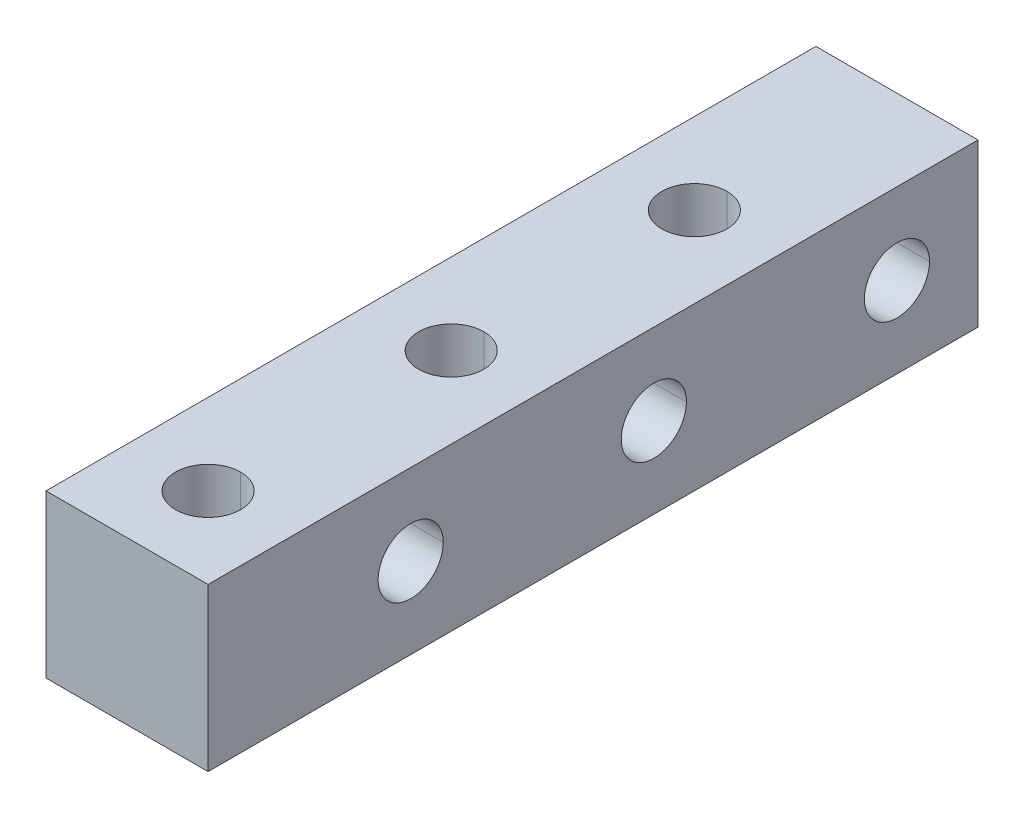
ISO-10303-21;
HEADER;
FILE_DESCRIPTION(('STEP AP214'),'2;1');
FILE_NAME('part.step','',(''),(''),'','','');
FILE_SCHEMA(('AUTOMOTIVE_DESIGN { 1 0 10303 214 1 1 1 1 }'));
ENDSEC;
DATA;
#1=APPLICATION_CONTEXT('core data for automotive mechanical design processes');
#2=APPLICATION_PROTOCOL_DEFINITION('international standard','automotive_design',2000,#1);
#3=PRODUCT_CONTEXT('',#1,'mechanical');
#4=PRODUCT('Part','Part','',(#3));
#5=PRODUCT_RELATED_PRODUCT_CATEGORY('part','',(#4));
#6=PRODUCT_DEFINITION_FORMATION('','',#4);
#7=PRODUCT_DEFINITION_CONTEXT('part definition',#1,'design');
#8=PRODUCT_DEFINITION('design','',#6,#7);
#9=PRODUCT_DEFINITION_SHAPE('','',#8);
#10=(LENGTH_UNIT() NAMED_UNIT(*) SI_UNIT(.MILLI.,.METRE.));
#11=(NAMED_UNIT(*) PLANE_ANGLE_UNIT() SI_UNIT($,.RADIAN.));
#12=(NAMED_UNIT(*) SI_UNIT($,.STERADIAN.) SOLID_ANGLE_UNIT());
#13=UNCERTAINTY_MEASURE_WITH_UNIT(LENGTH_MEASURE(1.E-05),#10,'distance_accuracy_value','');
#14=(GEOMETRIC_REPRESENTATION_CONTEXT(3) GLOBAL_UNCERTAINTY_ASSIGNED_CONTEXT((#13)) GLOBAL_UNIT_ASSIGNED_CONTEXT((#10,
#11,#12)) REPRESENTATION_CONTEXT('',''));
#15=CARTESIAN_POINT('',(0.,0.,0.));
#16=DIRECTION('',(0.,0.,1.));
#17=DIRECTION('',(1.,0.,0.));
#18=AXIS2_PLACEMENT_3D('',#15,#16,#17);
#19=CARTESIAN_POINT('',(6.35,0.,-53.975));
#20=DIRECTION('',(1.,0.,0.));
#21=DIRECTION('',(0.,0.,-1.));
#22=AXIS2_PLACEMENT_3D('',#19,#20,#21);
#23=CYLINDRICAL_SURFACE('',#22,2.5527);
#24=DIRECTION('',(1.,0.,0.));
#25=VECTOR('',#24,1.);
#26=CARTESIAN_POINT('',(6.35,0.,-51.4223));
#27=LINE('',#26,#25);
#28=CARTESIAN_POINT('',(-6.35,0.,-51.4223));
#29=VERTEX_POINT('',#28);
#30=CARTESIAN_POINT('',(6.35,0.,-51.4223));
#31=VERTEX_POINT('',#30);
#32=EDGE_CURVE('E278',#29,#31,#27,.T.);
#33=ORIENTED_EDGE('',*,*,#32,.F.);
#34=CARTESIAN_POINT('',(-6.35,0.,-53.975));
#35=DIRECTION('',(1.,0.,0.));
#36=DIRECTION('',(0.,0.,-1.));
#37=AXIS2_PLACEMENT_3D('',#34,#35,#36);
#38=CIRCLE('',#37,2.5527);
#39=CARTESIAN_POINT('',(-6.35,0.,-56.5277));
#40=VERTEX_POINT('',#39);
#41=EDGE_CURVE('E272',#40,#29,#38,.T.);
#42=ORIENTED_EDGE('',*,*,#41,.F.);
#43=DIRECTION('',(1.,0.,0.));
#44=VECTOR('',#43,1.);
#45=CARTESIAN_POINT('',(6.35,0.,-56.5277));
#46=LINE('',#45,#44);
#47=CARTESIAN_POINT('',(6.35,0.,-56.5277));
#48=VERTEX_POINT('',#47);
#49=EDGE_CURVE('E277',#40,#48,#46,.T.);
#50=ORIENTED_EDGE('',*,*,#49,.T.);
#51=CARTESIAN_POINT('',(6.35,0.,-53.975));
#52=DIRECTION('',(1.,0.,0.));
#53=DIRECTION('',(0.,0.,-1.));
#54=AXIS2_PLACEMENT_3D('',#51,#52,#53);
#55=CIRCLE('',#54,2.5527);
#56=EDGE_CURVE('E268',#48,#31,#55,.T.);
#57=ORIENTED_EDGE('',*,*,#56,.T.);
#58=EDGE_LOOP('',(#33,#42,#50,#57));
#59=FACE_BOUND('',#58,.T.);
#60=ADVANCED_FACE('F51',(#59),#23,.F.);
#61=CARTESIAN_POINT('',(6.35,0.,-34.925));
#62=DIRECTION('',(1.,0.,0.));
#63=DIRECTION('',(0.,0.,-1.));
#64=AXIS2_PLACEMENT_3D('',#61,#62,#63);
#65=CYLINDRICAL_SURFACE('',#64,2.5527);
#66=DIRECTION('',(1.,0.,0.));
#67=VECTOR('',#66,1.);
#68=CARTESIAN_POINT('',(6.35,0.,-32.3723));
#69=LINE('',#68,#67);
#70=CARTESIAN_POINT('',(-6.35,0.,-32.3723));
#71=VERTEX_POINT('',#70);
#72=CARTESIAN_POINT('',(6.35,0.,-32.3723));
#73=VERTEX_POINT('',#72);
#74=EDGE_CURVE('E279',#71,#73,#69,.T.);
#75=ORIENTED_EDGE('',*,*,#74,.F.);
#76=CARTESIAN_POINT('',(-6.35,0.,-34.925));
#77=DIRECTION('',(1.,0.,0.));
#78=DIRECTION('',(0.,0.,-1.));
#79=AXIS2_PLACEMENT_3D('',#76,#77,#78);
#80=CIRCLE('',#79,2.5527);
#81=CARTESIAN_POINT('',(-6.35,0.,-37.4777));
#82=VERTEX_POINT('',#81);
#83=EDGE_CURVE('E130',#82,#71,#80,.T.);
#84=ORIENTED_EDGE('',*,*,#83,.F.);
#85=DIRECTION('',(1.,0.,0.));
#86=VECTOR('',#85,1.);
#87=CARTESIAN_POINT('',(6.35,0.,-37.4777));
#88=LINE('',#87,#86);
#89=CARTESIAN_POINT('',(6.35,0.,-37.4777));
#90=VERTEX_POINT('',#89);
#91=EDGE_CURVE('E245',#82,#90,#88,.T.);
#92=ORIENTED_EDGE('',*,*,#91,.T.);
#93=CARTESIAN_POINT('',(6.35,0.,-34.925));
#94=DIRECTION('',(1.,0.,0.));
#95=DIRECTION('',(0.,0.,-1.));
#96=AXIS2_PLACEMENT_3D('',#93,#94,#95);
#97=CIRCLE('',#96,2.5527);
#98=EDGE_CURVE('E61',#90,#73,#97,.T.);
#99=ORIENTED_EDGE('',*,*,#98,.T.);
#100=EDGE_LOOP('',(#75,#84,#92,#99));
#101=FACE_BOUND('',#100,.T.);
#102=ADVANCED_FACE('F362',(#101),#65,.F.);
#103=CARTESIAN_POINT('',(0.,6.35,-44.45));
#104=DIRECTION('',(0.,1.,0.));
#105=DIRECTION('',(0.,0.,1.));
#106=AXIS2_PLACEMENT_3D('',#103,#104,#105);
#107=CYLINDRICAL_SURFACE('',#106,2.5527);
#108=DIRECTION('',(0.,1.,0.));
#109=VECTOR('',#108,1.);
#110=CARTESIAN_POINT('',(0.,6.35,-47.0027));
#111=LINE('',#110,#109);
#112=CARTESIAN_POINT('',(0.,-6.35,-47.0027));
#113=VERTEX_POINT('',#112);
#114=CARTESIAN_POINT('',(0.,6.35,-47.0027));
#115=VERTEX_POINT('',#114);
#116=EDGE_CURVE('E227',#113,#115,#111,.T.);
#117=ORIENTED_EDGE('',*,*,#116,.F.);
#118=CARTESIAN_POINT('',(0.,-6.35,-44.45));
#119=DIRECTION('',(0.,1.,0.));
#120=DIRECTION('',(0.,0.,1.));
#121=AXIS2_PLACEMENT_3D('',#118,#119,#120);
#122=CIRCLE('',#121,2.5527);
#123=CARTESIAN_POINT('',(0.,-6.35,-41.8973));
#124=VERTEX_POINT('',#123);
#125=EDGE_CURVE('E220',#124,#113,#122,.T.);
#126=ORIENTED_EDGE('',*,*,#125,.F.);
#127=DIRECTION('',(0.,1.,0.));
#128=VECTOR('',#127,1.);
#129=CARTESIAN_POINT('',(0.,6.35,-41.8973));
#130=LINE('',#129,#128);
#131=CARTESIAN_POINT('',(0.,6.35,-41.8973));
#132=VERTEX_POINT('',#131);
#133=EDGE_CURVE('E218',#124,#132,#130,.T.);
#134=ORIENTED_EDGE('',*,*,#133,.T.);
#135=CARTESIAN_POINT('',(0.,6.35,-44.45));
#136=DIRECTION('',(0.,1.,0.));
#137=DIRECTION('',(0.,0.,1.));
#138=AXIS2_PLACEMENT_3D('',#135,#136,#137);
#139=CIRCLE('',#138,2.5527);
#140=EDGE_CURVE('E206',#132,#115,#139,.T.);
#141=ORIENTED_EDGE('',*,*,#140,.T.);
#142=EDGE_LOOP('',(#117,#126,#134,#141));
#143=FACE_BOUND('',#142,.T.);
#144=ADVANCED_FACE('F219',(#143),#107,.F.);
#145=CARTESIAN_POINT('',(0.,6.35,-25.4));
#146=DIRECTION('',(0.,1.,0.));
#147=DIRECTION('',(0.,0.,1.));
#148=AXIS2_PLACEMENT_3D('',#145,#146,#147);
#149=CYLINDRICAL_SURFACE('',#148,2.5527);
#150=DIRECTION('',(0.,1.,0.));
#151=VECTOR('',#150,1.);
#152=CARTESIAN_POINT('',(0.,6.35,-27.9527));
#153=LINE('',#152,#151);
#154=CARTESIAN_POINT('',(0.,-6.35,-27.9527));
#155=VERTEX_POINT('',#154);
#156=CARTESIAN_POINT('',(0.,6.35,-27.9527));
#157=VERTEX_POINT('',#156);
#158=EDGE_CURVE('E255',#155,#157,#153,.T.);
#159=ORIENTED_EDGE('',*,*,#158,.F.);
#160=CARTESIAN_POINT('',(0.,-6.35,-25.4));
#161=DIRECTION('',(0.,1.,0.));
#162=DIRECTION('',(0.,0.,1.));
#163=AXIS2_PLACEMENT_3D('',#160,#161,#162);
#164=CIRCLE('',#163,2.5527);
#165=CARTESIAN_POINT('',(0.,-6.35,-22.8473));
#166=VERTEX_POINT('',#165);
#167=EDGE_CURVE('E200',#166,#155,#164,.T.);
#168=ORIENTED_EDGE('',*,*,#167,.F.);
#169=DIRECTION('',(0.,1.,0.));
#170=VECTOR('',#169,1.);
#171=CARTESIAN_POINT('',(0.,6.35,-22.8473));
#172=LINE('',#171,#170);
#173=CARTESIAN_POINT('',(0.,6.35,-22.8473));
#174=VERTEX_POINT('',#173);
#175=EDGE_CURVE('E249',#166,#174,#172,.T.);
#176=ORIENTED_EDGE('',*,*,#175,.T.);
#177=CARTESIAN_POINT('',(0.,6.35,-25.4));
#178=DIRECTION('',(0.,1.,0.));
#179=DIRECTION('',(0.,0.,1.));
#180=AXIS2_PLACEMENT_3D('',#177,#178,#179);
#181=CIRCLE('',#180,2.5527);
#182=EDGE_CURVE('E215',#174,#157,#181,.T.);
#183=ORIENTED_EDGE('',*,*,#182,.T.);
#184=EDGE_LOOP('',(#159,#168,#176,#183));
#185=FACE_BOUND('',#184,.T.);
#186=ADVANCED_FACE('F370',(#185),#149,.F.);
#187=CARTESIAN_POINT('',(6.35,0.,-15.875));
#188=DIRECTION('',(1.,0.,0.));
#189=DIRECTION('',(0.,0.,-1.));
#190=AXIS2_PLACEMENT_3D('',#187,#188,#189);
#191=CYLINDRICAL_SURFACE('',#190,2.5527);
#192=DIRECTION('',(1.,0.,0.));
#193=VECTOR('',#192,1.);
#194=CARTESIAN_POINT('',(6.35,0.,-13.3223));
#195=LINE('',#194,#193);
#196=CARTESIAN_POINT('',(-6.35,0.,-13.3223));
#197=VERTEX_POINT('',#196);
#198=CARTESIAN_POINT('',(6.35,0.,-13.3223));
#199=VERTEX_POINT('',#198);
#200=EDGE_CURVE('E294',#197,#199,#195,.T.);
#201=ORIENTED_EDGE('',*,*,#200,.F.);
#202=CARTESIAN_POINT('',(-6.35,0.,-15.875));
#203=DIRECTION('',(1.,0.,0.));
#204=DIRECTION('',(0.,0.,-1.));
#205=AXIS2_PLACEMENT_3D('',#202,#203,#204);
#206=CIRCLE('',#205,2.5527);
#207=CARTESIAN_POINT('',(-6.35,0.,-18.4277));
#208=VERTEX_POINT('',#207);
#209=EDGE_CURVE('E271',#208,#197,#206,.T.);
#210=ORIENTED_EDGE('',*,*,#209,.F.);
#211=DIRECTION('',(1.,0.,0.));
#212=VECTOR('',#211,1.);
#213=CARTESIAN_POINT('',(6.35,0.,-18.4277));
#214=LINE('',#213,#212);
#215=CARTESIAN_POINT('',(6.35,0.,-18.4277));
#216=VERTEX_POINT('',#215);
#217=EDGE_CURVE('E238',#208,#216,#214,.T.);
#218=ORIENTED_EDGE('',*,*,#217,.T.);
#219=CARTESIAN_POINT('',(6.35,0.,-15.875));
#220=DIRECTION('',(1.,0.,0.));
#221=DIRECTION('',(0.,0.,-1.));
#222=AXIS2_PLACEMENT_3D('',#219,#220,#221);
#223=CIRCLE('',#222,2.5527);
#224=EDGE_CURVE('E11',#216,#199,#223,.T.);
#225=ORIENTED_EDGE('',*,*,#224,.T.);
#226=EDGE_LOOP('',(#201,#210,#218,#225));
#227=FACE_BOUND('',#226,.T.);
#228=ADVANCED_FACE('F389',(#227),#191,.F.);
#229=CARTESIAN_POINT('',(0.,6.35,-6.35));
#230=DIRECTION('',(0.,1.,0.));
#231=DIRECTION('',(0.,0.,1.));
#232=AXIS2_PLACEMENT_3D('',#229,#230,#231);
#233=CYLINDRICAL_SURFACE('',#232,2.5527);
#234=DIRECTION('',(0.,1.,0.));
#235=VECTOR('',#234,1.);
#236=CARTESIAN_POINT('',(0.,6.35,-8.9027));
#237=LINE('',#236,#235);
#238=CARTESIAN_POINT('',(0.,-6.35,-8.9027));
#239=VERTEX_POINT('',#238);
#240=CARTESIAN_POINT('',(0.,6.35,-8.9027));
#241=VERTEX_POINT('',#240);
#242=EDGE_CURVE('E298',#239,#241,#237,.T.);
#243=ORIENTED_EDGE('',*,*,#242,.F.);
#244=CARTESIAN_POINT('',(0.,-6.35,-6.35));
#245=DIRECTION('',(0.,1.,0.));
#246=DIRECTION('',(0.,0.,1.));
#247=AXIS2_PLACEMENT_3D('',#244,#245,#246);
#248=CIRCLE('',#247,2.5527);
#249=CARTESIAN_POINT('',(0.,-6.35,-3.7973));
#250=VERTEX_POINT('',#249);
#251=EDGE_CURVE('E265',#250,#239,#248,.T.);
#252=ORIENTED_EDGE('',*,*,#251,.F.);
#253=DIRECTION('',(0.,1.,0.));
#254=VECTOR('',#253,1.);
#255=CARTESIAN_POINT('',(0.,6.35,-3.7973));
#256=LINE('',#255,#254);
#257=CARTESIAN_POINT('',(0.,6.35,-3.7973));
#258=VERTEX_POINT('',#257);
#259=EDGE_CURVE('E240',#250,#258,#256,.T.);
#260=ORIENTED_EDGE('',*,*,#259,.T.);
#261=CARTESIAN_POINT('',(0.,6.35,-6.35));
#262=DIRECTION('',(0.,1.,0.));
#263=DIRECTION('',(0.,0.,1.));
#264=AXIS2_PLACEMENT_3D('',#261,#262,#263);
#265=CIRCLE('',#264,2.5527);
#266=EDGE_CURVE('E303',#258,#241,#265,.T.);
#267=ORIENTED_EDGE('',*,*,#266,.T.);
#268=EDGE_LOOP('',(#243,#252,#260,#267));
#269=FACE_BOUND('',#268,.T.);
#270=ADVANCED_FACE('F387',(#269),#233,.F.);
#271=CARTESIAN_POINT('',(-6.35,6.35,0.));
#272=DIRECTION('',(0.,0.,1.));
#273=DIRECTION('',(1.,0.,0.));
#274=AXIS2_PLACEMENT_3D('',#271,#272,#273);
#275=PLANE('',#274);
#276=DIRECTION('',(0.,-1.,0.));
#277=VECTOR('',#276,1.);
#278=CARTESIAN_POINT('',(-6.35,-6.35,0.));
#279=LINE('',#278,#277);
#280=CARTESIAN_POINT('',(-6.35,6.35,0.));
#281=VERTEX_POINT('',#280);
#282=CARTESIAN_POINT('',(-6.35,-6.35,0.));
#283=VERTEX_POINT('',#282);
#284=EDGE_CURVE('E301',#281,#283,#279,.T.);
#285=ORIENTED_EDGE('',*,*,#284,.T.);
#286=DIRECTION('',(1.,0.,0.));
#287=VECTOR('',#286,1.);
#288=CARTESIAN_POINT('',(6.35,-6.35,0.));
#289=LINE('',#288,#287);
#290=CARTESIAN_POINT('',(6.35,-6.35,0.));
#291=VERTEX_POINT('',#290);
#292=EDGE_CURVE('E259',#283,#291,#289,.T.);
#293=ORIENTED_EDGE('',*,*,#292,.T.);
#294=DIRECTION('',(0.,1.,0.));
#295=VECTOR('',#294,1.);
#296=CARTESIAN_POINT('',(6.35,-6.35,0.));
#297=LINE('',#296,#295);
#298=CARTESIAN_POINT('',(6.35,6.35,0.));
#299=VERTEX_POINT('',#298);
#300=EDGE_CURVE('E306',#291,#299,#297,.T.);
#301=ORIENTED_EDGE('',*,*,#300,.T.);
#302=DIRECTION('',(-1.,0.,0.));
#303=VECTOR('',#302,1.);
#304=CARTESIAN_POINT('',(6.35,6.35,0.));
#305=LINE('',#304,#303);
#306=EDGE_CURVE('E284',#299,#281,#305,.T.);
#307=ORIENTED_EDGE('',*,*,#306,.T.);
#308=EDGE_LOOP('',(#285,#293,#301,#307));
#309=FACE_BOUND('',#308,.T.);
#310=ADVANCED_FACE('F384',(#309),#275,.T.);
#311=CARTESIAN_POINT('',(6.35,-6.35,-85.725));
#312=DIRECTION('',(1.,0.,0.));
#313=DIRECTION('',(0.,1.,0.));
#314=AXIS2_PLACEMENT_3D('',#311,#312,#313);
#315=PLANE('',#314);
#316=DIRECTION('',(0.,-1.,0.));
#317=VECTOR('',#316,1.);
#318=CARTESIAN_POINT('',(6.35,6.35,-60.325));
#319=LINE('',#318,#317);
#320=CARTESIAN_POINT('',(6.35,6.35,-60.325));
#321=VERTEX_POINT('',#320);
#322=CARTESIAN_POINT('',(6.35,-6.35,-60.325));
#323=VERTEX_POINT('',#322);
#324=EDGE_CURVE('E69',#321,#323,#319,.T.);
#325=ORIENTED_EDGE('',*,*,#324,.F.);
#326=DIRECTION('',(0.,0.,1.));
#327=VECTOR('',#326,1.);
#328=CARTESIAN_POINT('',(6.35,6.35,-85.725));
#329=LINE('',#328,#327);
#330=EDGE_CURVE('E81',#321,#299,#329,.T.);
#331=ORIENTED_EDGE('',*,*,#330,.T.);
#332=ORIENTED_EDGE('',*,*,#300,.F.);
#333=DIRECTION('',(0.,0.,1.));
#334=VECTOR('',#333,1.);
#335=CARTESIAN_POINT('',(6.35,-6.35,-85.725));
#336=LINE('',#335,#334);
#337=EDGE_CURVE('E243',#323,#291,#336,.T.);
#338=ORIENTED_EDGE('',*,*,#337,.F.);
#339=EDGE_LOOP('',(#325,#331,#332,#338));
#340=FACE_BOUND('',#339,.T.);
#341=ORIENTED_EDGE('',*,*,#224,.F.);
#342=CARTESIAN_POINT('',(6.35,0.,-15.875));
#343=DIRECTION('',(1.,0.,0.));
#344=DIRECTION('',(0.,0.,-1.));
#345=AXIS2_PLACEMENT_3D('',#342,#343,#344);
#346=CIRCLE('',#345,2.5527);
#347=EDGE_CURVE('E307',#199,#216,#346,.T.);
#348=ORIENTED_EDGE('',*,*,#347,.F.);
#349=EDGE_LOOP('',(#341,#348));
#350=FACE_BOUND('',#349,.T.);
#351=ORIENTED_EDGE('',*,*,#98,.F.);
#352=CARTESIAN_POINT('',(6.35,0.,-34.925));
#353=DIRECTION('',(1.,0.,0.));
#354=DIRECTION('',(0.,0.,-1.));
#355=AXIS2_PLACEMENT_3D('',#352,#353,#354);
#356=CIRCLE('',#355,2.5527);
#357=EDGE_CURVE('E248',#73,#90,#356,.T.);
#358=ORIENTED_EDGE('',*,*,#357,.F.);
#359=EDGE_LOOP('',(#351,#358));
#360=FACE_BOUND('',#359,.T.);
#361=ORIENTED_EDGE('',*,*,#56,.F.);
#362=CARTESIAN_POINT('',(6.35,0.,-53.975));
#363=DIRECTION('',(1.,0.,0.));
#364=DIRECTION('',(0.,0.,-1.));
#365=AXIS2_PLACEMENT_3D('',#362,#363,#364);
#366=CIRCLE('',#365,2.5527);
#367=EDGE_CURVE('E273',#31,#48,#366,.T.);
#368=ORIENTED_EDGE('',*,*,#367,.F.);
#369=EDGE_LOOP('',(#361,#368));
#370=FACE_BOUND('',#369,.T.);
#371=ADVANCED_FACE('F53',(#340,#350,#360,#370),#315,.T.);
#372=CARTESIAN_POINT('',(6.35,6.35,-85.725));
#373=DIRECTION('',(0.,1.,0.));
#374=DIRECTION('',(1.,0.,0.));
#375=AXIS2_PLACEMENT_3D('',#372,#373,#374);
#376=PLANE('',#375);
#377=DIRECTION('',(1.,0.,0.));
#378=VECTOR('',#377,1.);
#379=CARTESIAN_POINT('',(-6.35,6.35,-60.325));
#380=LINE('',#379,#378);
#381=CARTESIAN_POINT('',(-6.35,6.35,-60.325));
#382=VERTEX_POINT('',#381);
#383=EDGE_CURVE('E431',#382,#321,#380,.T.);
#384=ORIENTED_EDGE('',*,*,#383,.F.);
#385=DIRECTION('',(0.,0.,1.));
#386=VECTOR('',#385,1.);
#387=CARTESIAN_POINT('',(-6.35,6.35,-85.725));
#388=LINE('',#387,#386);
#389=EDGE_CURVE('E342',#382,#281,#388,.T.);
#390=ORIENTED_EDGE('',*,*,#389,.T.);
#391=ORIENTED_EDGE('',*,*,#306,.F.);
#392=ORIENTED_EDGE('',*,*,#330,.F.);
#393=EDGE_LOOP('',(#384,#390,#391,#392));
#394=FACE_BOUND('',#393,.T.);
#395=ORIENTED_EDGE('',*,*,#266,.F.);
#396=CARTESIAN_POINT('',(0.,6.35,-6.35));
#397=DIRECTION('',(0.,1.,0.));
#398=DIRECTION('',(0.,0.,1.));
#399=AXIS2_PLACEMENT_3D('',#396,#397,#398);
#400=CIRCLE('',#399,2.5527);
#401=EDGE_CURVE('E244',#241,#258,#400,.T.);
#402=ORIENTED_EDGE('',*,*,#401,.F.);
#403=EDGE_LOOP('',(#395,#402));
#404=FACE_BOUND('',#403,.T.);
#405=ORIENTED_EDGE('',*,*,#182,.F.);
#406=CARTESIAN_POINT('',(0.,6.35,-25.4));
#407=DIRECTION('',(0.,1.,0.));
#408=DIRECTION('',(0.,0.,1.));
#409=AXIS2_PLACEMENT_3D('',#406,#407,#408);
#410=CIRCLE('',#409,2.5527);
#411=EDGE_CURVE('E254',#157,#174,#410,.T.);
#412=ORIENTED_EDGE('',*,*,#411,.F.);
#413=EDGE_LOOP('',(#405,#412));
#414=FACE_BOUND('',#413,.T.);
#415=ORIENTED_EDGE('',*,*,#140,.F.);
#416=CARTESIAN_POINT('',(0.,6.35,-44.45));
#417=DIRECTION('',(0.,1.,0.));
#418=DIRECTION('',(0.,0.,1.));
#419=AXIS2_PLACEMENT_3D('',#416,#417,#418);
#420=CIRCLE('',#419,2.5527);
#421=EDGE_CURVE('E210',#115,#132,#420,.T.);
#422=ORIENTED_EDGE('',*,*,#421,.F.);
#423=EDGE_LOOP('',(#415,#422));
#424=FACE_BOUND('',#423,.T.);
#425=ADVANCED_FACE('F208',(#394,#404,#414,#424),#376,.T.);
#426=CARTESIAN_POINT('',(-6.35,-6.35,-85.725));
#427=DIRECTION('',(-1.,0.,0.));
#428=DIRECTION('',(0.,0.,1.));
#429=AXIS2_PLACEMENT_3D('',#426,#427,#428);
#430=PLANE('',#429);
#431=DIRECTION('',(0.,-1.,0.));
#432=VECTOR('',#431,1.);
#433=CARTESIAN_POINT('',(-6.35,6.35,-60.325));
#434=LINE('',#433,#432);
#435=CARTESIAN_POINT('',(-6.35,-6.35,-60.325));
#436=VERTEX_POINT('',#435);
#437=EDGE_CURVE('E453',#382,#436,#434,.T.);
#438=ORIENTED_EDGE('',*,*,#437,.T.);
#439=DIRECTION('',(0.,0.,1.));
#440=VECTOR('',#439,1.);
#441=CARTESIAN_POINT('',(-6.35,-6.35,-85.725));
#442=LINE('',#441,#440);
#443=EDGE_CURVE('E55',#436,#283,#442,.T.);
#444=ORIENTED_EDGE('',*,*,#443,.T.);
#445=ORIENTED_EDGE('',*,*,#284,.F.);
#446=ORIENTED_EDGE('',*,*,#389,.F.);
#447=EDGE_LOOP('',(#438,#444,#445,#446));
#448=FACE_BOUND('',#447,.T.);
#449=ORIENTED_EDGE('',*,*,#209,.T.);
#450=CARTESIAN_POINT('',(-6.35,0.,-15.875));
#451=DIRECTION('',(1.,0.,0.));
#452=DIRECTION('',(0.,0.,-1.));
#453=AXIS2_PLACEMENT_3D('',#450,#451,#452);
#454=CIRCLE('',#453,2.5527);
#455=EDGE_CURVE('E253',#197,#208,#454,.T.);
#456=ORIENTED_EDGE('',*,*,#455,.T.);
#457=EDGE_LOOP('',(#449,#456));
#458=FACE_BOUND('',#457,.T.);
#459=ORIENTED_EDGE('',*,*,#83,.T.);
#460=CARTESIAN_POINT('',(-6.35,0.,-34.925));
#461=DIRECTION('',(1.,0.,0.));
#462=DIRECTION('',(0.,0.,-1.));
#463=AXIS2_PLACEMENT_3D('',#460,#461,#462);
#464=CIRCLE('',#463,2.5527);
#465=EDGE_CURVE('E283',#71,#82,#464,.T.);
#466=ORIENTED_EDGE('',*,*,#465,.T.);
#467=EDGE_LOOP('',(#459,#466));
#468=FACE_BOUND('',#467,.T.);
#469=ORIENTED_EDGE('',*,*,#41,.T.);
#470=CARTESIAN_POINT('',(-6.35,0.,-53.975));
#471=DIRECTION('',(1.,0.,0.));
#472=DIRECTION('',(0.,0.,-1.));
#473=AXIS2_PLACEMENT_3D('',#470,#471,#472);
#474=CIRCLE('',#473,2.5527);
#475=EDGE_CURVE('E286',#29,#40,#474,.T.);
#476=ORIENTED_EDGE('',*,*,#475,.T.);
#477=EDGE_LOOP('',(#469,#476));
#478=FACE_BOUND('',#477,.T.);
#479=ADVANCED_FACE('F357',(#448,#458,#468,#478),#430,.T.);
#480=CARTESIAN_POINT('',(6.35,-6.35,-85.725));
#481=DIRECTION('',(0.,-1.,0.));
#482=DIRECTION('',(0.,0.,-1.));
#483=AXIS2_PLACEMENT_3D('',#480,#481,#482);
#484=PLANE('',#483);
#485=DIRECTION('',(1.,0.,0.));
#486=VECTOR('',#485,1.);
#487=CARTESIAN_POINT('',(-6.35,-6.35,-60.325));
#488=LINE('',#487,#486);
#489=EDGE_CURVE('E290',#436,#323,#488,.T.);
#490=ORIENTED_EDGE('',*,*,#489,.T.);
#491=ORIENTED_EDGE('',*,*,#337,.T.);
#492=ORIENTED_EDGE('',*,*,#292,.F.);
#493=ORIENTED_EDGE('',*,*,#443,.F.);
#494=EDGE_LOOP('',(#490,#491,#492,#493));
#495=FACE_BOUND('',#494,.T.);
#496=ORIENTED_EDGE('',*,*,#125,.T.);
#497=CARTESIAN_POINT('',(0.,-6.35,-44.45));
#498=DIRECTION('',(0.,1.,0.));
#499=DIRECTION('',(0.,0.,1.));
#500=AXIS2_PLACEMENT_3D('',#497,#498,#499);
#501=CIRCLE('',#500,2.5527);
#502=EDGE_CURVE('E234',#113,#124,#501,.T.);
#503=ORIENTED_EDGE('',*,*,#502,.T.);
#504=EDGE_LOOP('',(#496,#503));
#505=FACE_BOUND('',#504,.T.);
#506=ORIENTED_EDGE('',*,*,#167,.T.);
#507=CARTESIAN_POINT('',(0.,-6.35,-25.4));
#508=DIRECTION('',(0.,1.,0.));
#509=DIRECTION('',(0.,0.,1.));
#510=AXIS2_PLACEMENT_3D('',#507,#508,#509);
#511=CIRCLE('',#510,2.5527);
#512=EDGE_CURVE('E225',#155,#166,#511,.T.);
#513=ORIENTED_EDGE('',*,*,#512,.T.);
#514=EDGE_LOOP('',(#506,#513));
#515=FACE_BOUND('',#514,.T.);
#516=ORIENTED_EDGE('',*,*,#251,.T.);
#517=CARTESIAN_POINT('',(0.,-6.35,-6.35));
#518=DIRECTION('',(0.,1.,0.));
#519=DIRECTION('',(0.,0.,1.));
#520=AXIS2_PLACEMENT_3D('',#517,#518,#519);
#521=CIRCLE('',#520,2.5527);
#522=EDGE_CURVE('E314',#239,#250,#521,.T.);
#523=ORIENTED_EDGE('',*,*,#522,.T.);
#524=EDGE_LOOP('',(#516,#523));
#525=FACE_BOUND('',#524,.T.);
#526=ADVANCED_FACE('F379',(#495,#505,#515,#525),#484,.T.);
#527=CARTESIAN_POINT('',(0.,6.35,-6.35));
#528=DIRECTION('',(0.,1.,0.));
#529=DIRECTION('',(0.,0.,1.));
#530=AXIS2_PLACEMENT_3D('',#527,#528,#529);
#531=CYLINDRICAL_SURFACE('',#530,2.5527);
#532=ORIENTED_EDGE('',*,*,#522,.F.);
#533=ORIENTED_EDGE('',*,*,#242,.T.);
#534=ORIENTED_EDGE('',*,*,#401,.T.);
#535=ORIENTED_EDGE('',*,*,#259,.F.);
#536=EDGE_LOOP('',(#532,#533,#534,#535));
#537=FACE_BOUND('',#536,.T.);
#538=ADVANCED_FACE('F412',(#537),#531,.F.);
#539=CARTESIAN_POINT('',(6.35,0.,-15.875));
#540=DIRECTION('',(1.,0.,0.));
#541=DIRECTION('',(0.,0.,-1.));
#542=AXIS2_PLACEMENT_3D('',#539,#540,#541);
#543=CYLINDRICAL_SURFACE('',#542,2.5527);
#544=ORIENTED_EDGE('',*,*,#455,.F.);
#545=ORIENTED_EDGE('',*,*,#200,.T.);
#546=ORIENTED_EDGE('',*,*,#347,.T.);
#547=ORIENTED_EDGE('',*,*,#217,.F.);
#548=EDGE_LOOP('',(#544,#545,#546,#547));
#549=FACE_BOUND('',#548,.T.);
#550=ADVANCED_FACE('F405',(#549),#543,.F.);
#551=CARTESIAN_POINT('',(0.,6.35,-25.4));
#552=DIRECTION('',(0.,1.,0.));
#553=DIRECTION('',(0.,0.,1.));
#554=AXIS2_PLACEMENT_3D('',#551,#552,#553);
#555=CYLINDRICAL_SURFACE('',#554,2.5527);
#556=ORIENTED_EDGE('',*,*,#512,.F.);
#557=ORIENTED_EDGE('',*,*,#158,.T.);
#558=ORIENTED_EDGE('',*,*,#411,.T.);
#559=ORIENTED_EDGE('',*,*,#175,.F.);
#560=EDGE_LOOP('',(#556,#557,#558,#559));
#561=FACE_BOUND('',#560,.T.);
#562=ADVANCED_FACE('F403',(#561),#555,.F.);
#563=CARTESIAN_POINT('',(0.,6.35,-44.45));
#564=DIRECTION('',(0.,1.,0.));
#565=DIRECTION('',(0.,0.,1.));
#566=AXIS2_PLACEMENT_3D('',#563,#564,#565);
#567=CYLINDRICAL_SURFACE('',#566,2.5527);
#568=ORIENTED_EDGE('',*,*,#502,.F.);
#569=ORIENTED_EDGE('',*,*,#116,.T.);
#570=ORIENTED_EDGE('',*,*,#421,.T.);
#571=ORIENTED_EDGE('',*,*,#133,.F.);
#572=EDGE_LOOP('',(#568,#569,#570,#571));
#573=FACE_BOUND('',#572,.T.);
#574=ADVANCED_FACE('F226',(#573),#567,.F.);
#575=CARTESIAN_POINT('',(6.35,0.,-34.925));
#576=DIRECTION('',(1.,0.,0.));
#577=DIRECTION('',(0.,0.,-1.));
#578=AXIS2_PLACEMENT_3D('',#575,#576,#577);
#579=CYLINDRICAL_SURFACE('',#578,2.5527);
#580=ORIENTED_EDGE('',*,*,#465,.F.);
#581=ORIENTED_EDGE('',*,*,#74,.T.);
#582=ORIENTED_EDGE('',*,*,#357,.T.);
#583=ORIENTED_EDGE('',*,*,#91,.F.);
#584=EDGE_LOOP('',(#580,#581,#582,#583));
#585=FACE_BOUND('',#584,.T.);
#586=ADVANCED_FACE('F360',(#585),#579,.F.);
#587=CARTESIAN_POINT('',(6.35,0.,-53.975));
#588=DIRECTION('',(1.,0.,0.));
#589=DIRECTION('',(0.,0.,-1.));
#590=AXIS2_PLACEMENT_3D('',#587,#588,#589);
#591=CYLINDRICAL_SURFACE('',#590,2.5527);
#592=ORIENTED_EDGE('',*,*,#475,.F.);
#593=ORIENTED_EDGE('',*,*,#32,.T.);
#594=ORIENTED_EDGE('',*,*,#367,.T.);
#595=ORIENTED_EDGE('',*,*,#49,.F.);
#596=EDGE_LOOP('',(#592,#593,#594,#595));
#597=FACE_BOUND('',#596,.T.);
#598=ADVANCED_FACE('F383',(#597),#591,.F.);
#599=CARTESIAN_POINT('',(-6.35,6.35,-60.325));
#600=DIRECTION('',(0.,0.,1.));
#601=DIRECTION('',(1.,0.,0.));
#602=AXIS2_PLACEMENT_3D('',#599,#600,#601);
#603=PLANE('',#602);
#604=ORIENTED_EDGE('',*,*,#324,.T.);
#605=ORIENTED_EDGE('',*,*,#489,.F.);
#606=ORIENTED_EDGE('',*,*,#437,.F.);
#607=ORIENTED_EDGE('',*,*,#383,.T.);
#608=EDGE_LOOP('',(#604,#605,#606,#607));
#609=FACE_BOUND('',#608,.T.);
#610=ADVANCED_FACE('F394',(#609),#603,.F.);
#611=CLOSED_SHELL('',(#60,#102,#144,#186,#228,#270,#310,#371,#425,#479,#526,#538,#550,#562,#574,
#586,#598,#610));
#612=MANIFOLD_SOLID_BREP('B2',#611);
#613=ADVANCED_BREP_SHAPE_REPRESENTATION('',(#18,#612),#14);
#614=SHAPE_DEFINITION_REPRESENTATION(#9,#613);
ENDSEC;
END-ISO-10303-21;
